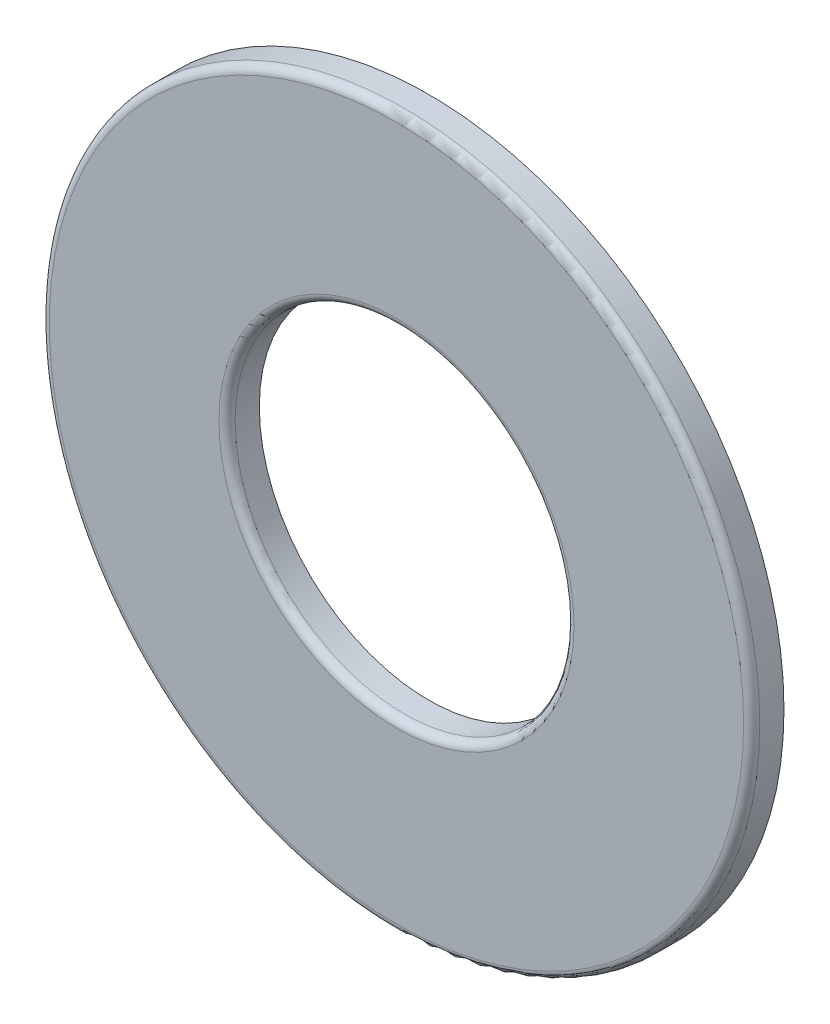
ISO-10303-21;
HEADER;
FILE_DESCRIPTION(('STEP AP214'),'2;1');
FILE_NAME('part.step','',(''),(''),'','','');
FILE_SCHEMA(('AUTOMOTIVE_DESIGN { 1 0 10303 214 1 1 1 1 }'));
ENDSEC;
DATA;
#1=APPLICATION_CONTEXT('core data for automotive mechanical design processes');
#2=APPLICATION_PROTOCOL_DEFINITION('international standard','automotive_design',2000,#1);
#3=PRODUCT_CONTEXT('',#1,'mechanical');
#4=PRODUCT('Part','Part','',(#3));
#5=PRODUCT_RELATED_PRODUCT_CATEGORY('part','',(#4));
#6=PRODUCT_DEFINITION_FORMATION('','',#4);
#7=PRODUCT_DEFINITION_CONTEXT('part definition',#1,'design');
#8=PRODUCT_DEFINITION('design','',#6,#7);
#9=PRODUCT_DEFINITION_SHAPE('','',#8);
#10=(LENGTH_UNIT() NAMED_UNIT(*) SI_UNIT(.MILLI.,.METRE.));
#11=(NAMED_UNIT(*) PLANE_ANGLE_UNIT() SI_UNIT($,.RADIAN.));
#12=(NAMED_UNIT(*) SI_UNIT($,.STERADIAN.) SOLID_ANGLE_UNIT());
#13=UNCERTAINTY_MEASURE_WITH_UNIT(LENGTH_MEASURE(1.E-05),#10,'distance_accuracy_value','');
#14=(GEOMETRIC_REPRESENTATION_CONTEXT(3) GLOBAL_UNCERTAINTY_ASSIGNED_CONTEXT((#13)) GLOBAL_UNIT_ASSIGNED_CONTEXT((#10,
#11,#12)) REPRESENTATION_CONTEXT('',''));
#15=CARTESIAN_POINT('',(0.,0.,0.));
#16=DIRECTION('',(0.,0.,1.));
#17=DIRECTION('',(1.,0.,0.));
#18=AXIS2_PLACEMENT_3D('',#15,#16,#17);
#19=CARTESIAN_POINT('',(0.,0.,1.5875));
#20=DIRECTION('',(0.,0.,1.));
#21=DIRECTION('',(1.,0.,0.));
#22=AXIS2_PLACEMENT_3D('',#19,#20,#21);
#23=PLANE('',#22);
#24=CARTESIAN_POINT('',(0.,0.,1.5875));
#25=DIRECTION('',(0.,0.,1.));
#26=DIRECTION('',(1.,0.,0.));
#27=AXIS2_PLACEMENT_3D('',#24,#25,#26);
#28=CIRCLE('',#27,34.13125);
#29=CARTESIAN_POINT('',(34.13125,0.,1.5875));
#30=VERTEX_POINT('',#29);
#31=EDGE_CURVE('E46',#30,#30,#28,.T.);
#32=ORIENTED_EDGE('',*,*,#31,.T.);
#33=EDGE_LOOP('',(#32));
#34=FACE_BOUND('',#33,.T.);
#35=CARTESIAN_POINT('',(0.,0.,1.5875));
#36=DIRECTION('',(0.,0.,1.));
#37=DIRECTION('',(1.,0.,0.));
#38=AXIS2_PLACEMENT_3D('',#35,#36,#37);
#39=CIRCLE('',#38,17.45615);
#40=CARTESIAN_POINT('',(17.45615,0.,1.5875));
#41=VERTEX_POINT('',#40);
#42=EDGE_CURVE('E50',#41,#41,#39,.F.);
#43=ORIENTED_EDGE('',*,*,#42,.T.);
#44=EDGE_LOOP('',(#43));
#45=FACE_BOUND('',#44,.T.);
#46=ADVANCED_FACE('F35',(#34,#45),#23,.T.);
#47=CARTESIAN_POINT('',(0.,0.,1.5875));
#48=DIRECTION('',(0.,0.,-1.));
#49=DIRECTION('',(-1.,0.,0.));
#50=AXIS2_PLACEMENT_3D('',#47,#48,#49);
#51=CYLINDRICAL_SURFACE('',#50,34.925);
#52=CARTESIAN_POINT('',(0.,0.,0.793750000000002));
#53=DIRECTION('',(0.,0.,1.));
#54=DIRECTION('',(1.,0.,0.));
#55=AXIS2_PLACEMENT_3D('',#52,#53,#54);
#56=CIRCLE('',#55,34.925);
#57=CARTESIAN_POINT('',(34.925,0.,0.793750000000002));
#58=VERTEX_POINT('',#57);
#59=EDGE_CURVE('E42',#58,#58,#56,.F.);
#60=ORIENTED_EDGE('',*,*,#59,.T.);
#61=EDGE_LOOP('',(#60));
#62=FACE_BOUND('',#61,.T.);
#63=CARTESIAN_POINT('',(0.,0.,-1.5875));
#64=DIRECTION('',(0.,0.,1.));
#65=DIRECTION('',(1.,0.,0.));
#66=AXIS2_PLACEMENT_3D('',#63,#64,#65);
#67=CIRCLE('',#66,34.925);
#68=CARTESIAN_POINT('',(34.925,0.,-1.5875));
#69=VERTEX_POINT('',#68);
#70=EDGE_CURVE('E55',#69,#69,#67,.T.);
#71=ORIENTED_EDGE('',*,*,#70,.T.);
#72=EDGE_LOOP('',(#71));
#73=FACE_BOUND('',#72,.T.);
#74=ADVANCED_FACE('F67',(#62,#73),#51,.T.);
#75=CARTESIAN_POINT('',(0.,0.,1.5875));
#76=DIRECTION('',(0.,0.,-1.));
#77=DIRECTION('',(-1.,0.,0.));
#78=AXIS2_PLACEMENT_3D('',#75,#76,#77);
#79=CYLINDRICAL_SURFACE('',#78,16.6624);
#80=CARTESIAN_POINT('',(0.,0.,0.793750000000002));
#81=DIRECTION('',(0.,0.,1.));
#82=DIRECTION('',(1.,0.,0.));
#83=AXIS2_PLACEMENT_3D('',#80,#81,#82);
#84=CIRCLE('',#83,16.6624);
#85=CARTESIAN_POINT('',(16.6624,0.,0.793750000000002));
#86=VERTEX_POINT('',#85);
#87=EDGE_CURVE('E10',#86,#86,#84,.T.);
#88=ORIENTED_EDGE('',*,*,#87,.T.);
#89=EDGE_LOOP('',(#88));
#90=FACE_BOUND('',#89,.T.);
#91=CARTESIAN_POINT('',(0.,0.,-1.5875));
#92=DIRECTION('',(0.,0.,1.));
#93=DIRECTION('',(1.,0.,0.));
#94=AXIS2_PLACEMENT_3D('',#91,#92,#93);
#95=CIRCLE('',#94,16.6624);
#96=CARTESIAN_POINT('',(16.6624,0.,-1.5875));
#97=VERTEX_POINT('',#96);
#98=EDGE_CURVE('E58',#97,#97,#95,.T.);
#99=ORIENTED_EDGE('',*,*,#98,.F.);
#100=EDGE_LOOP('',(#99));
#101=FACE_BOUND('',#100,.T.);
#102=ADVANCED_FACE('F65',(#90,#101),#79,.F.);
#103=CARTESIAN_POINT('',(0.,0.,-1.5875));
#104=DIRECTION('',(0.,0.,1.));
#105=DIRECTION('',(1.,0.,0.));
#106=AXIS2_PLACEMENT_3D('',#103,#104,#105);
#107=PLANE('',#106);
#108=ORIENTED_EDGE('',*,*,#98,.T.);
#109=EDGE_LOOP('',(#108));
#110=FACE_BOUND('',#109,.T.);
#111=ORIENTED_EDGE('',*,*,#70,.F.);
#112=EDGE_LOOP('',(#111));
#113=FACE_BOUND('',#112,.T.);
#114=ADVANCED_FACE('F62',(#110,#113),#107,.F.);
#115=CARTESIAN_POINT('',(0.,0.,0.793750000000002));
#116=DIRECTION('',(0.,0.,1.));
#117=DIRECTION('',(1.,0.,0.));
#118=AXIS2_PLACEMENT_3D('',#115,#116,#117);
#119=TOROIDAL_SURFACE('',#118,34.13125,0.79375);
#120=ORIENTED_EDGE('',*,*,#59,.F.);
#121=EDGE_LOOP('',(#120));
#122=FACE_BOUND('',#121,.T.);
#123=ORIENTED_EDGE('',*,*,#31,.F.);
#124=EDGE_LOOP('',(#123));
#125=FACE_BOUND('',#124,.T.);
#126=ADVANCED_FACE('F73',(#122,#125),#119,.T.);
#127=CARTESIAN_POINT('',(0.,0.,0.793750000000002));
#128=DIRECTION('',(0.,0.,1.));
#129=DIRECTION('',(1.,0.,0.));
#130=AXIS2_PLACEMENT_3D('',#127,#128,#129);
#131=TOROIDAL_SURFACE('',#130,17.45615,0.79375);
#132=ORIENTED_EDGE('',*,*,#42,.F.);
#133=EDGE_LOOP('',(#132));
#134=FACE_BOUND('',#133,.T.);
#135=ORIENTED_EDGE('',*,*,#87,.F.);
#136=EDGE_LOOP('',(#135));
#137=FACE_BOUND('',#136,.T.);
#138=ADVANCED_FACE('F37',(#134,#137),#131,.T.);
#139=CLOSED_SHELL('',(#46,#74,#102,#114,#126,#138));
#140=MANIFOLD_SOLID_BREP('B2',#139);
#141=ADVANCED_BREP_SHAPE_REPRESENTATION('',(#18,#140),#14);
#142=SHAPE_DEFINITION_REPRESENTATION(#9,#141);
ENDSEC;
END-ISO-10303-21;
